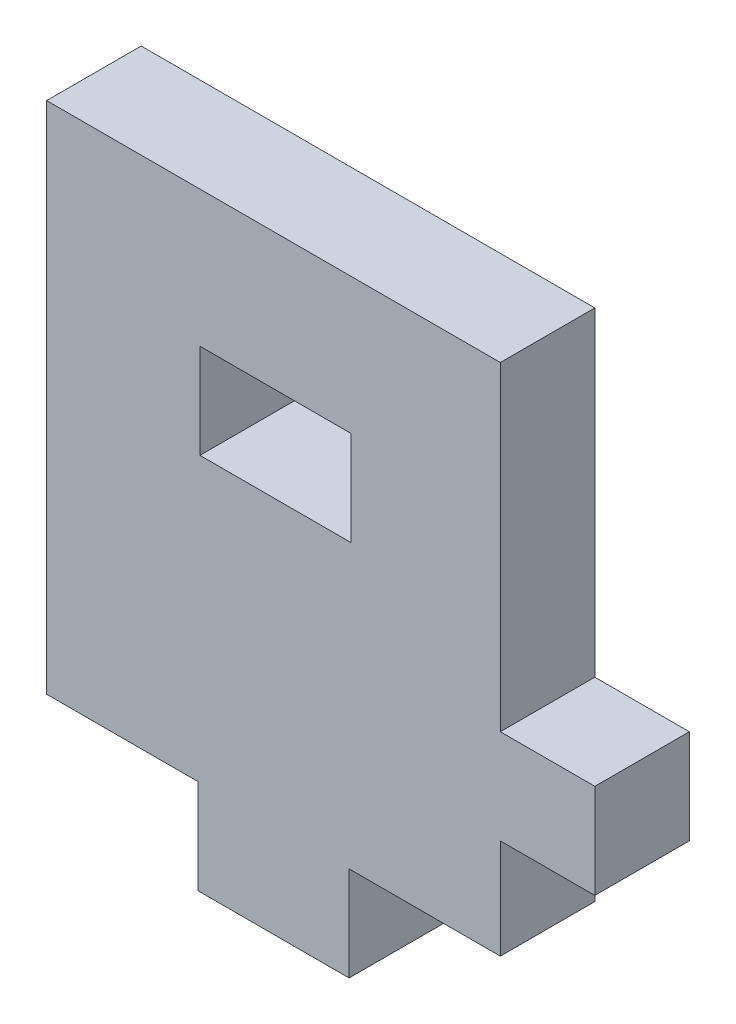
ISO-10303-21;
HEADER;
FILE_DESCRIPTION(('STEP AP214'),'2;1');
FILE_NAME('part.step','',(''),(''),'','','');
FILE_SCHEMA(('AUTOMOTIVE_DESIGN { 1 0 10303 214 1 1 1 1 }'));
ENDSEC;
DATA;
#1=APPLICATION_CONTEXT('core data for automotive mechanical design processes');
#2=APPLICATION_PROTOCOL_DEFINITION('international standard','automotive_design',2000,#1);
#3=PRODUCT_CONTEXT('',#1,'mechanical');
#4=PRODUCT('Part','Part','',(#3));
#5=PRODUCT_RELATED_PRODUCT_CATEGORY('part','',(#4));
#6=PRODUCT_DEFINITION_FORMATION('','',#4);
#7=PRODUCT_DEFINITION_CONTEXT('part definition',#1,'design');
#8=PRODUCT_DEFINITION('design','',#6,#7);
#9=PRODUCT_DEFINITION_SHAPE('','',#8);
#10=(LENGTH_UNIT() NAMED_UNIT(*) SI_UNIT(.MILLI.,.METRE.));
#11=(NAMED_UNIT(*) PLANE_ANGLE_UNIT() SI_UNIT($,.RADIAN.));
#12=(NAMED_UNIT(*) SI_UNIT($,.STERADIAN.) SOLID_ANGLE_UNIT());
#13=UNCERTAINTY_MEASURE_WITH_UNIT(LENGTH_MEASURE(1.E-05),#10,'distance_accuracy_value','');
#14=(GEOMETRIC_REPRESENTATION_CONTEXT(3) GLOBAL_UNCERTAINTY_ASSIGNED_CONTEXT((#13)) GLOBAL_UNIT_ASSIGNED_CONTEXT((#10,
#11,#12)) REPRESENTATION_CONTEXT('',''));
#15=CARTESIAN_POINT('',(0.,0.,0.));
#16=DIRECTION('',(0.,0.,1.));
#17=DIRECTION('',(1.,0.,0.));
#18=AXIS2_PLACEMENT_3D('',#15,#16,#17);
#19=CARTESIAN_POINT('',(-15.24,-17.272,3.175));
#20=DIRECTION('',(0.,1.,0.));
#21=DIRECTION('',(0.,0.,1.));
#22=AXIS2_PLACEMENT_3D('',#19,#20,#21);
#23=PLANE('',#22);
#24=DIRECTION('',(0.,0.,1.));
#25=VECTOR('',#24,1.);
#26=CARTESIAN_POINT('',(5.08000000000001,-17.272,-3.175));
#27=LINE('',#26,#25);
#28=CARTESIAN_POINT('',(5.08000000000001,-17.272,-3.175));
#29=VERTEX_POINT('',#28);
#30=CARTESIAN_POINT('',(5.08000000000001,-17.272,3.175));
#31=VERTEX_POINT('',#30);
#32=EDGE_CURVE('E191',#29,#31,#27,.T.);
#33=ORIENTED_EDGE('',*,*,#32,.F.);
#34=DIRECTION('',(1.,0.,0.));
#35=VECTOR('',#34,1.);
#36=CARTESIAN_POINT('',(-15.24,-17.272,-3.175));
#37=LINE('',#36,#35);
#38=CARTESIAN_POINT('',(15.24,-17.272,-3.175));
#39=VERTEX_POINT('',#38);
#40=EDGE_CURVE('E239',#29,#39,#37,.T.);
#41=ORIENTED_EDGE('',*,*,#40,.T.);
#42=DIRECTION('',(0.,0.,-1.));
#43=VECTOR('',#42,1.);
#44=CARTESIAN_POINT('',(15.24,-17.272,3.175));
#45=LINE('',#44,#43);
#46=CARTESIAN_POINT('',(15.24,-17.272,3.175));
#47=VERTEX_POINT('',#46);
#48=EDGE_CURVE('E246',#47,#39,#45,.T.);
#49=ORIENTED_EDGE('',*,*,#48,.F.);
#50=DIRECTION('',(1.,0.,0.));
#51=VECTOR('',#50,1.);
#52=CARTESIAN_POINT('',(-15.24,-17.272,3.175));
#53=LINE('',#52,#51);
#54=EDGE_CURVE('E327',#31,#47,#53,.T.);
#55=ORIENTED_EDGE('',*,*,#54,.F.);
#56=EDGE_LOOP('',(#33,#41,#49,#55));
#57=FACE_BOUND('',#56,.T.);
#58=ADVANCED_FACE('F35',(#57),#23,.F.);
#59=CARTESIAN_POINT('',(15.24,-17.272,3.175));
#60=DIRECTION('',(-1.,0.,0.));
#61=DIRECTION('',(0.,0.,1.));
#62=AXIS2_PLACEMENT_3D('',#59,#60,#61);
#63=PLANE('',#62);
#64=DIRECTION('',(0.,0.,1.));
#65=VECTOR('',#64,1.);
#66=CARTESIAN_POINT('',(15.24,-4.21291232342499,-3.175));
#67=LINE('',#66,#65);
#68=CARTESIAN_POINT('',(15.24,-4.21291232342499,-3.175));
#69=VERTEX_POINT('',#68);
#70=CARTESIAN_POINT('',(15.24,-4.21291232342499,3.175));
#71=VERTEX_POINT('',#70);
#72=EDGE_CURVE('E220',#69,#71,#67,.T.);
#73=ORIENTED_EDGE('',*,*,#72,.F.);
#74=DIRECTION('',(0.,1.,0.));
#75=VECTOR('',#74,1.);
#76=CARTESIAN_POINT('',(15.24,-17.272,-3.175));
#77=LINE('',#76,#75);
#78=CARTESIAN_POINT('',(15.24,17.272,-3.175));
#79=VERTEX_POINT('',#78);
#80=EDGE_CURVE('E223',#69,#79,#77,.T.);
#81=ORIENTED_EDGE('',*,*,#80,.T.);
#82=DIRECTION('',(0.,0.,-1.));
#83=VECTOR('',#82,1.);
#84=CARTESIAN_POINT('',(15.24,17.272,3.175));
#85=LINE('',#84,#83);
#86=CARTESIAN_POINT('',(15.24,17.272,3.175));
#87=VERTEX_POINT('',#86);
#88=EDGE_CURVE('E170',#87,#79,#85,.T.);
#89=ORIENTED_EDGE('',*,*,#88,.F.);
#90=DIRECTION('',(0.,1.,0.));
#91=VECTOR('',#90,1.);
#92=CARTESIAN_POINT('',(15.24,-17.272,3.175));
#93=LINE('',#92,#91);
#94=EDGE_CURVE('E238',#71,#87,#93,.T.);
#95=ORIENTED_EDGE('',*,*,#94,.F.);
#96=EDGE_LOOP('',(#73,#81,#89,#95));
#97=FACE_BOUND('',#96,.T.);
#98=ADVANCED_FACE('F315',(#97),#63,.F.);
#99=CARTESIAN_POINT('',(15.24,-10.562912323425,-3.175));
#100=VERTEX_POINT('',#99);
#101=EDGE_CURVE('E256',#39,#100,#77,.T.);
#102=ORIENTED_EDGE('',*,*,#101,.T.);
#103=DIRECTION('',(0.,0.,1.));
#104=VECTOR('',#103,1.);
#105=CARTESIAN_POINT('',(15.24,-10.562912323425,-3.175));
#106=LINE('',#105,#104);
#107=CARTESIAN_POINT('',(15.24,-10.562912323425,3.175));
#108=VERTEX_POINT('',#107);
#109=EDGE_CURVE('E227',#100,#108,#106,.T.);
#110=ORIENTED_EDGE('',*,*,#109,.T.);
#111=EDGE_CURVE('E284',#47,#108,#93,.T.);
#112=ORIENTED_EDGE('',*,*,#111,.F.);
#113=ORIENTED_EDGE('',*,*,#48,.T.);
#114=EDGE_LOOP('',(#102,#110,#112,#113));
#115=FACE_BOUND('',#114,.T.);
#116=ADVANCED_FACE('F37',(#115),#63,.F.);
#117=CARTESIAN_POINT('',(-15.24,17.272,3.175));
#118=DIRECTION('',(0.,-1.,0.));
#119=DIRECTION('',(0.,0.,-1.));
#120=AXIS2_PLACEMENT_3D('',#117,#118,#119);
#121=PLANE('',#120);
#122=DIRECTION('',(-1.,0.,0.));
#123=VECTOR('',#122,1.);
#124=CARTESIAN_POINT('',(-15.24,17.272,-3.175));
#125=LINE('',#124,#123);
#126=CARTESIAN_POINT('',(-15.24,17.272,-3.175));
#127=VERTEX_POINT('',#126);
#128=EDGE_CURVE('E260',#79,#127,#125,.T.);
#129=ORIENTED_EDGE('',*,*,#128,.T.);
#130=DIRECTION('',(0.,0.,-1.));
#131=VECTOR('',#130,1.);
#132=CARTESIAN_POINT('',(-15.24,17.272,3.175));
#133=LINE('',#132,#131);
#134=CARTESIAN_POINT('',(-15.24,17.272,3.175));
#135=VERTEX_POINT('',#134);
#136=EDGE_CURVE('E172',#135,#127,#133,.T.);
#137=ORIENTED_EDGE('',*,*,#136,.F.);
#138=DIRECTION('',(-1.,0.,0.));
#139=VECTOR('',#138,1.);
#140=CARTESIAN_POINT('',(-15.24,17.272,3.175));
#141=LINE('',#140,#139);
#142=EDGE_CURVE('E300',#87,#135,#141,.T.);
#143=ORIENTED_EDGE('',*,*,#142,.F.);
#144=ORIENTED_EDGE('',*,*,#88,.T.);
#145=EDGE_LOOP('',(#129,#137,#143,#144));
#146=FACE_BOUND('',#145,.T.);
#147=ADVANCED_FACE('F313',(#146),#121,.F.);
#148=CARTESIAN_POINT('',(-15.24,-17.272,3.175));
#149=DIRECTION('',(1.,0.,0.));
#150=DIRECTION('',(0.,0.,-1.));
#151=AXIS2_PLACEMENT_3D('',#148,#149,#150);
#152=PLANE('',#151);
#153=DIRECTION('',(0.,-1.,0.));
#154=VECTOR('',#153,1.);
#155=CARTESIAN_POINT('',(-15.24,-17.272,-3.175));
#156=LINE('',#155,#154);
#157=CARTESIAN_POINT('',(-15.24,-17.272,-3.175));
#158=VERTEX_POINT('',#157);
#159=EDGE_CURVE('E244',#127,#158,#156,.T.);
#160=ORIENTED_EDGE('',*,*,#159,.T.);
#161=DIRECTION('',(0.,0.,-1.));
#162=VECTOR('',#161,1.);
#163=CARTESIAN_POINT('',(-15.24,-17.272,3.175));
#164=LINE('',#163,#162);
#165=CARTESIAN_POINT('',(-15.24,-17.272,3.175));
#166=VERTEX_POINT('',#165);
#167=EDGE_CURVE('E250',#166,#158,#164,.T.);
#168=ORIENTED_EDGE('',*,*,#167,.F.);
#169=DIRECTION('',(0.,-1.,0.));
#170=VECTOR('',#169,1.);
#171=CARTESIAN_POINT('',(-15.24,-17.272,3.175));
#172=LINE('',#171,#170);
#173=EDGE_CURVE('E305',#135,#166,#172,.T.);
#174=ORIENTED_EDGE('',*,*,#173,.F.);
#175=ORIENTED_EDGE('',*,*,#136,.T.);
#176=EDGE_LOOP('',(#160,#168,#174,#175));
#177=FACE_BOUND('',#176,.T.);
#178=ADVANCED_FACE('F326',(#177),#152,.F.);
#179=CARTESIAN_POINT('',(-5.07999999999999,-17.272,-3.175));
#180=VERTEX_POINT('',#179);
#181=EDGE_CURVE('E234',#158,#180,#37,.T.);
#182=ORIENTED_EDGE('',*,*,#181,.T.);
#183=DIRECTION('',(0.,0.,1.));
#184=VECTOR('',#183,1.);
#185=CARTESIAN_POINT('',(-5.07999999999999,-17.272,-3.175));
#186=LINE('',#185,#184);
#187=CARTESIAN_POINT('',(-5.07999999999999,-17.272,3.175));
#188=VERTEX_POINT('',#187);
#189=EDGE_CURVE('E194',#180,#188,#186,.T.);
#190=ORIENTED_EDGE('',*,*,#189,.T.);
#191=EDGE_CURVE('E251',#166,#188,#53,.T.);
#192=ORIENTED_EDGE('',*,*,#191,.F.);
#193=ORIENTED_EDGE('',*,*,#167,.T.);
#194=EDGE_LOOP('',(#182,#190,#192,#193));
#195=FACE_BOUND('',#194,.T.);
#196=ADVANCED_FACE('F323',(#195),#23,.F.);
#197=CARTESIAN_POINT('',(15.24,17.272,3.175));
#198=DIRECTION('',(0.,0.,-1.));
#199=DIRECTION('',(-1.,0.,0.));
#200=AXIS2_PLACEMENT_3D('',#197,#198,#199);
#201=PLANE('',#200);
#202=DIRECTION('',(-1.,0.,0.));
#203=VECTOR('',#202,1.);
#204=CARTESIAN_POINT('',(-4.9415507951959,1.778,3.175));
#205=LINE('',#204,#203);
#206=CARTESIAN_POINT('',(5.2184492048041,1.778,3.175));
#207=VERTEX_POINT('',#206);
#208=CARTESIAN_POINT('',(-4.9415507951959,1.778,3.175));
#209=VERTEX_POINT('',#208);
#210=EDGE_CURVE('E51',#207,#209,#205,.T.);
#211=ORIENTED_EDGE('',*,*,#210,.T.);
#212=DIRECTION('',(0.,-1.,0.));
#213=VECTOR('',#212,1.);
#214=CARTESIAN_POINT('',(-4.9415507951959,8.128,3.175));
#215=LINE('',#214,#213);
#216=CARTESIAN_POINT('',(-4.9415507951959,8.128,3.175));
#217=VERTEX_POINT('',#216);
#218=EDGE_CURVE('E333',#217,#209,#215,.T.);
#219=ORIENTED_EDGE('',*,*,#218,.F.);
#220=DIRECTION('',(-1.,0.,0.));
#221=VECTOR('',#220,1.);
#222=CARTESIAN_POINT('',(-4.9415507951959,8.128,3.175));
#223=LINE('',#222,#221);
#224=CARTESIAN_POINT('',(5.2184492048041,8.128,3.175));
#225=VERTEX_POINT('',#224);
#226=EDGE_CURVE('E156',#225,#217,#223,.T.);
#227=ORIENTED_EDGE('',*,*,#226,.F.);
#228=DIRECTION('',(0.,-1.,0.));
#229=VECTOR('',#228,1.);
#230=CARTESIAN_POINT('',(5.2184492048041,8.128,3.175));
#231=LINE('',#230,#229);
#232=EDGE_CURVE('E452',#225,#207,#231,.T.);
#233=ORIENTED_EDGE('',*,*,#232,.T.);
#234=EDGE_LOOP('',(#211,#219,#227,#233));
#235=FACE_BOUND('',#234,.T.);
#236=ORIENTED_EDGE('',*,*,#111,.T.);
#237=DIRECTION('',(1.,0.,0.));
#238=VECTOR('',#237,1.);
#239=CARTESIAN_POINT('',(15.24,-10.562912323425,3.175));
#240=LINE('',#239,#238);
#241=CARTESIAN_POINT('',(21.59,-10.562912323425,3.175));
#242=VERTEX_POINT('',#241);
#243=EDGE_CURVE('E214',#108,#242,#240,.T.);
#244=ORIENTED_EDGE('',*,*,#243,.T.);
#245=DIRECTION('',(0.,1.,0.));
#246=VECTOR('',#245,1.);
#247=CARTESIAN_POINT('',(21.59,-4.21291232342499,3.175));
#248=LINE('',#247,#246);
#249=CARTESIAN_POINT('',(21.59,-4.21291232342499,3.175));
#250=VERTEX_POINT('',#249);
#251=EDGE_CURVE('E210',#242,#250,#248,.T.);
#252=ORIENTED_EDGE('',*,*,#251,.T.);
#253=DIRECTION('',(-1.,0.,0.));
#254=VECTOR('',#253,1.);
#255=CARTESIAN_POINT('',(15.24,-4.21291232342499,3.175));
#256=LINE('',#255,#254);
#257=EDGE_CURVE('E213',#250,#71,#256,.T.);
#258=ORIENTED_EDGE('',*,*,#257,.T.);
#259=ORIENTED_EDGE('',*,*,#94,.T.);
#260=ORIENTED_EDGE('',*,*,#142,.T.);
#261=ORIENTED_EDGE('',*,*,#173,.T.);
#262=ORIENTED_EDGE('',*,*,#191,.T.);
#263=DIRECTION('',(0.,-1.,0.));
#264=VECTOR('',#263,1.);
#265=CARTESIAN_POINT('',(-5.07999999999999,-17.272,3.175));
#266=LINE('',#265,#264);
#267=CARTESIAN_POINT('',(-5.07999999999999,-23.622,3.175));
#268=VERTEX_POINT('',#267);
#269=EDGE_CURVE('E330',#188,#268,#266,.T.);
#270=ORIENTED_EDGE('',*,*,#269,.T.);
#271=DIRECTION('',(1.,0.,0.));
#272=VECTOR('',#271,1.);
#273=CARTESIAN_POINT('',(-5.07999999999999,-23.622,3.175));
#274=LINE('',#273,#272);
#275=CARTESIAN_POINT('',(5.08000000000001,-23.622,3.175));
#276=VERTEX_POINT('',#275);
#277=EDGE_CURVE('E184',#268,#276,#274,.T.);
#278=ORIENTED_EDGE('',*,*,#277,.T.);
#279=DIRECTION('',(0.,1.,0.));
#280=VECTOR('',#279,1.);
#281=CARTESIAN_POINT('',(5.08000000000001,-17.272,3.175));
#282=LINE('',#281,#280);
#283=EDGE_CURVE('E180',#276,#31,#282,.T.);
#284=ORIENTED_EDGE('',*,*,#283,.T.);
#285=ORIENTED_EDGE('',*,*,#54,.T.);
#286=EDGE_LOOP('',(#236,#244,#252,#258,#259,#260,#261,#262,#270,#278,#284,#285));
#287=FACE_BOUND('',#286,.T.);
#288=ADVANCED_FACE('F308',(#235,#287),#201,.F.);
#289=CARTESIAN_POINT('',(15.24,17.272,-3.175));
#290=DIRECTION('',(0.,0.,-1.));
#291=DIRECTION('',(-1.,0.,0.));
#292=AXIS2_PLACEMENT_3D('',#289,#290,#291);
#293=PLANE('',#292);
#294=DIRECTION('',(0.,-1.,0.));
#295=VECTOR('',#294,1.);
#296=CARTESIAN_POINT('',(-4.94155079519589,8.128,-3.175));
#297=LINE('',#296,#295);
#298=CARTESIAN_POINT('',(-4.94155079519589,8.128,-3.175));
#299=VERTEX_POINT('',#298);
#300=CARTESIAN_POINT('',(-4.94155079519589,1.778,-3.175));
#301=VERTEX_POINT('',#300);
#302=EDGE_CURVE('E162',#299,#301,#297,.T.);
#303=ORIENTED_EDGE('',*,*,#302,.T.);
#304=DIRECTION('',(1.,0.,0.));
#305=VECTOR('',#304,1.);
#306=CARTESIAN_POINT('',(15.24,1.778,-3.175));
#307=LINE('',#306,#305);
#308=CARTESIAN_POINT('',(5.2184492048041,1.778,-3.175));
#309=VERTEX_POINT('',#308);
#310=EDGE_CURVE('E11',#301,#309,#307,.T.);
#311=ORIENTED_EDGE('',*,*,#310,.T.);
#312=DIRECTION('',(0.,-1.,0.));
#313=VECTOR('',#312,1.);
#314=CARTESIAN_POINT('',(5.2184492048041,8.128,-3.175));
#315=LINE('',#314,#313);
#316=CARTESIAN_POINT('',(5.2184492048041,8.128,-3.175));
#317=VERTEX_POINT('',#316);
#318=EDGE_CURVE('E166',#317,#309,#315,.T.);
#319=ORIENTED_EDGE('',*,*,#318,.F.);
#320=DIRECTION('',(1.,0.,0.));
#321=VECTOR('',#320,1.);
#322=CARTESIAN_POINT('',(15.24,8.128,-3.175));
#323=LINE('',#322,#321);
#324=EDGE_CURVE('E44',#299,#317,#323,.T.);
#325=ORIENTED_EDGE('',*,*,#324,.F.);
#326=EDGE_LOOP('',(#303,#311,#319,#325));
#327=FACE_BOUND('',#326,.T.);
#328=ORIENTED_EDGE('',*,*,#128,.F.);
#329=ORIENTED_EDGE('',*,*,#80,.F.);
#330=DIRECTION('',(-1.,0.,0.));
#331=VECTOR('',#330,1.);
#332=CARTESIAN_POINT('',(15.24,-4.21291232342499,-3.175));
#333=LINE('',#332,#331);
#334=CARTESIAN_POINT('',(21.59,-4.21291232342499,-3.175));
#335=VERTEX_POINT('',#334);
#336=EDGE_CURVE('E208',#335,#69,#333,.T.);
#337=ORIENTED_EDGE('',*,*,#336,.F.);
#338=DIRECTION('',(0.,1.,0.));
#339=VECTOR('',#338,1.);
#340=CARTESIAN_POINT('',(21.59,-4.21291232342499,-3.175));
#341=LINE('',#340,#339);
#342=CARTESIAN_POINT('',(21.59,-10.562912323425,-3.175));
#343=VERTEX_POINT('',#342);
#344=EDGE_CURVE('E205',#343,#335,#341,.T.);
#345=ORIENTED_EDGE('',*,*,#344,.F.);
#346=DIRECTION('',(1.,0.,0.));
#347=VECTOR('',#346,1.);
#348=CARTESIAN_POINT('',(15.24,-10.562912323425,-3.175));
#349=LINE('',#348,#347);
#350=EDGE_CURVE('E209',#100,#343,#349,.T.);
#351=ORIENTED_EDGE('',*,*,#350,.F.);
#352=ORIENTED_EDGE('',*,*,#101,.F.);
#353=ORIENTED_EDGE('',*,*,#40,.F.);
#354=DIRECTION('',(0.,1.,0.));
#355=VECTOR('',#354,1.);
#356=CARTESIAN_POINT('',(5.08000000000001,-17.272,-3.175));
#357=LINE('',#356,#355);
#358=CARTESIAN_POINT('',(5.08000000000001,-23.622,-3.175));
#359=VERTEX_POINT('',#358);
#360=EDGE_CURVE('E187',#359,#29,#357,.T.);
#361=ORIENTED_EDGE('',*,*,#360,.F.);
#362=DIRECTION('',(1.,0.,0.));
#363=VECTOR('',#362,1.);
#364=CARTESIAN_POINT('',(-5.07999999999999,-23.622,-3.175));
#365=LINE('',#364,#363);
#366=CARTESIAN_POINT('',(-5.07999999999999,-23.622,-3.175));
#367=VERTEX_POINT('',#366);
#368=EDGE_CURVE('E190',#367,#359,#365,.T.);
#369=ORIENTED_EDGE('',*,*,#368,.F.);
#370=DIRECTION('',(0.,-1.,0.));
#371=VECTOR('',#370,1.);
#372=CARTESIAN_POINT('',(-5.07999999999999,-17.272,-3.175));
#373=LINE('',#372,#371);
#374=EDGE_CURVE('E183',#180,#367,#373,.T.);
#375=ORIENTED_EDGE('',*,*,#374,.F.);
#376=ORIENTED_EDGE('',*,*,#181,.F.);
#377=ORIENTED_EDGE('',*,*,#159,.F.);
#378=EDGE_LOOP('',(#328,#329,#337,#345,#351,#352,#353,#361,#369,#375,#376,#377));
#379=FACE_BOUND('',#378,.T.);
#380=ADVANCED_FACE('F168',(#327,#379),#293,.T.);
#381=CARTESIAN_POINT('',(15.24,-4.21291232342499,-3.175));
#382=DIRECTION('',(0.,1.,0.));
#383=DIRECTION('',(0.,0.,1.));
#384=AXIS2_PLACEMENT_3D('',#381,#382,#383);
#385=PLANE('',#384);
#386=ORIENTED_EDGE('',*,*,#257,.F.);
#387=DIRECTION('',(0.,0.,1.));
#388=VECTOR('',#387,1.);
#389=CARTESIAN_POINT('',(21.59,-4.21291232342499,-3.175));
#390=LINE('',#389,#388);
#391=EDGE_CURVE('E217',#335,#250,#390,.T.);
#392=ORIENTED_EDGE('',*,*,#391,.F.);
#393=ORIENTED_EDGE('',*,*,#336,.T.);
#394=ORIENTED_EDGE('',*,*,#72,.T.);
#395=EDGE_LOOP('',(#386,#392,#393,#394));
#396=FACE_BOUND('',#395,.T.);
#397=ADVANCED_FACE('F409',(#396),#385,.T.);
#398=CARTESIAN_POINT('',(21.59,-4.21291232342499,-3.175));
#399=DIRECTION('',(1.,0.,0.));
#400=DIRECTION('',(0.,0.,-1.));
#401=AXIS2_PLACEMENT_3D('',#398,#399,#400);
#402=PLANE('',#401);
#403=ORIENTED_EDGE('',*,*,#251,.F.);
#404=DIRECTION('',(0.,0.,1.));
#405=VECTOR('',#404,1.);
#406=CARTESIAN_POINT('',(21.59,-10.562912323425,-3.175));
#407=LINE('',#406,#405);
#408=EDGE_CURVE('E293',#343,#242,#407,.T.);
#409=ORIENTED_EDGE('',*,*,#408,.F.);
#410=ORIENTED_EDGE('',*,*,#344,.T.);
#411=ORIENTED_EDGE('',*,*,#391,.T.);
#412=EDGE_LOOP('',(#403,#409,#410,#411));
#413=FACE_BOUND('',#412,.T.);
#414=ADVANCED_FACE('F505',(#413),#402,.T.);
#415=CARTESIAN_POINT('',(15.24,-10.562912323425,-3.175));
#416=DIRECTION('',(0.,-1.,0.));
#417=DIRECTION('',(0.,0.,-1.));
#418=AXIS2_PLACEMENT_3D('',#415,#416,#417);
#419=PLANE('',#418);
#420=ORIENTED_EDGE('',*,*,#243,.F.);
#421=ORIENTED_EDGE('',*,*,#109,.F.);
#422=ORIENTED_EDGE('',*,*,#350,.T.);
#423=ORIENTED_EDGE('',*,*,#408,.T.);
#424=EDGE_LOOP('',(#420,#421,#422,#423));
#425=FACE_BOUND('',#424,.T.);
#426=ADVANCED_FACE('F358',(#425),#419,.T.);
#427=CARTESIAN_POINT('',(-5.07999999999999,-17.272,-3.175));
#428=DIRECTION('',(-1.,0.,0.));
#429=DIRECTION('',(0.,-1.,0.));
#430=AXIS2_PLACEMENT_3D('',#427,#428,#429);
#431=PLANE('',#430);
#432=ORIENTED_EDGE('',*,*,#269,.F.);
#433=ORIENTED_EDGE('',*,*,#189,.F.);
#434=ORIENTED_EDGE('',*,*,#374,.T.);
#435=DIRECTION('',(0.,0.,1.));
#436=VECTOR('',#435,1.);
#437=CARTESIAN_POINT('',(-5.07999999999999,-23.622,-3.175));
#438=LINE('',#437,#436);
#439=EDGE_CURVE('E189',#367,#268,#438,.T.);
#440=ORIENTED_EDGE('',*,*,#439,.T.);
#441=EDGE_LOOP('',(#432,#433,#434,#440));
#442=FACE_BOUND('',#441,.T.);
#443=ADVANCED_FACE('F350',(#442),#431,.T.);
#444=CARTESIAN_POINT('',(5.08000000000001,-17.272,-3.175));
#445=DIRECTION('',(1.,0.,0.));
#446=DIRECTION('',(0.,0.,-1.));
#447=AXIS2_PLACEMENT_3D('',#444,#445,#446);
#448=PLANE('',#447);
#449=ORIENTED_EDGE('',*,*,#283,.F.);
#450=DIRECTION('',(0.,0.,1.));
#451=VECTOR('',#450,1.);
#452=CARTESIAN_POINT('',(5.08000000000001,-23.622,-3.175));
#453=LINE('',#452,#451);
#454=EDGE_CURVE('E195',#359,#276,#453,.T.);
#455=ORIENTED_EDGE('',*,*,#454,.F.);
#456=ORIENTED_EDGE('',*,*,#360,.T.);
#457=ORIENTED_EDGE('',*,*,#32,.T.);
#458=EDGE_LOOP('',(#449,#455,#456,#457));
#459=FACE_BOUND('',#458,.T.);
#460=ADVANCED_FACE('F348',(#459),#448,.T.);
#461=CARTESIAN_POINT('',(-5.07999999999999,-23.622,-3.175));
#462=DIRECTION('',(0.,-1.,0.));
#463=DIRECTION('',(0.,0.,-1.));
#464=AXIS2_PLACEMENT_3D('',#461,#462,#463);
#465=PLANE('',#464);
#466=ORIENTED_EDGE('',*,*,#277,.F.);
#467=ORIENTED_EDGE('',*,*,#439,.F.);
#468=ORIENTED_EDGE('',*,*,#368,.T.);
#469=ORIENTED_EDGE('',*,*,#454,.T.);
#470=EDGE_LOOP('',(#466,#467,#468,#469));
#471=FACE_BOUND('',#470,.T.);
#472=ADVANCED_FACE('F346',(#471),#465,.T.);
#473=CARTESIAN_POINT('',(15.3784492048041,1.778,-3.175));
#474=DIRECTION('',(0.,1.,0.));
#475=DIRECTION('',(0.,0.,1.));
#476=AXIS2_PLACEMENT_3D('',#473,#474,#475);
#477=PLANE('',#476);
#478=DIRECTION('',(0.,0.,-1.));
#479=VECTOR('',#478,1.);
#480=CARTESIAN_POINT('',(-4.94155079519589,1.778,-3.175));
#481=LINE('',#480,#479);
#482=EDGE_CURVE('E164',#209,#301,#481,.T.);
#483=ORIENTED_EDGE('',*,*,#482,.F.);
#484=ORIENTED_EDGE('',*,*,#210,.F.);
#485=DIRECTION('',(0.,0.,1.));
#486=VECTOR('',#485,1.);
#487=CARTESIAN_POINT('',(5.2184492048041,1.778,-3.175));
#488=LINE('',#487,#486);
#489=EDGE_CURVE('E450',#309,#207,#488,.T.);
#490=ORIENTED_EDGE('',*,*,#489,.F.);
#491=ORIENTED_EDGE('',*,*,#310,.F.);
#492=EDGE_LOOP('',(#483,#484,#490,#491));
#493=FACE_BOUND('',#492,.T.);
#494=ADVANCED_FACE('F356',(#493),#477,.T.);
#495=CARTESIAN_POINT('',(15.3784492048041,8.128,-3.175));
#496=DIRECTION('',(0.,1.,0.));
#497=DIRECTION('',(0.,0.,1.));
#498=AXIS2_PLACEMENT_3D('',#495,#496,#497);
#499=PLANE('',#498);
#500=ORIENTED_EDGE('',*,*,#324,.T.);
#501=DIRECTION('',(0.,0.,1.));
#502=VECTOR('',#501,1.);
#503=CARTESIAN_POINT('',(5.2184492048041,8.128,-3.175));
#504=LINE('',#503,#502);
#505=EDGE_CURVE('E59',#317,#225,#504,.T.);
#506=ORIENTED_EDGE('',*,*,#505,.T.);
#507=ORIENTED_EDGE('',*,*,#226,.T.);
#508=DIRECTION('',(0.,0.,-1.));
#509=VECTOR('',#508,1.);
#510=CARTESIAN_POINT('',(-4.94155079519589,8.128,-3.175));
#511=LINE('',#510,#509);
#512=EDGE_CURVE('E150',#217,#299,#511,.T.);
#513=ORIENTED_EDGE('',*,*,#512,.T.);
#514=EDGE_LOOP('',(#500,#506,#507,#513));
#515=FACE_BOUND('',#514,.T.);
#516=ADVANCED_FACE('F152',(#515),#499,.F.);
#517=CARTESIAN_POINT('',(-4.94155079519589,8.128,-3.175));
#518=DIRECTION('',(-1.,0.,0.));
#519=DIRECTION('',(0.,0.,-1.));
#520=AXIS2_PLACEMENT_3D('',#517,#518,#519);
#521=PLANE('',#520);
#522=ORIENTED_EDGE('',*,*,#482,.T.);
#523=ORIENTED_EDGE('',*,*,#302,.F.);
#524=ORIENTED_EDGE('',*,*,#512,.F.);
#525=ORIENTED_EDGE('',*,*,#218,.T.);
#526=EDGE_LOOP('',(#522,#523,#524,#525));
#527=FACE_BOUND('',#526,.T.);
#528=ADVANCED_FACE('F163',(#527),#521,.F.);
#529=CARTESIAN_POINT('',(5.2184492048041,8.128,-3.175));
#530=DIRECTION('',(1.,0.,0.));
#531=DIRECTION('',(0.,0.,1.));
#532=AXIS2_PLACEMENT_3D('',#529,#530,#531);
#533=PLANE('',#532);
#534=ORIENTED_EDGE('',*,*,#489,.T.);
#535=ORIENTED_EDGE('',*,*,#232,.F.);
#536=ORIENTED_EDGE('',*,*,#505,.F.);
#537=ORIENTED_EDGE('',*,*,#318,.T.);
#538=EDGE_LOOP('',(#534,#535,#536,#537));
#539=FACE_BOUND('',#538,.T.);
#540=ADVANCED_FACE('F438',(#539),#533,.F.);
#541=CLOSED_SHELL('',(#58,#98,#116,#147,#178,#196,#288,#380,#397,#414,#426,#443,#460,#472,#494,
#516,#528,#540));
#542=MANIFOLD_SOLID_BREP('B2',#541);
#543=ADVANCED_BREP_SHAPE_REPRESENTATION('',(#18,#542),#14);
#544=SHAPE_DEFINITION_REPRESENTATION(#9,#543);
ENDSEC;
END-ISO-10303-21;
